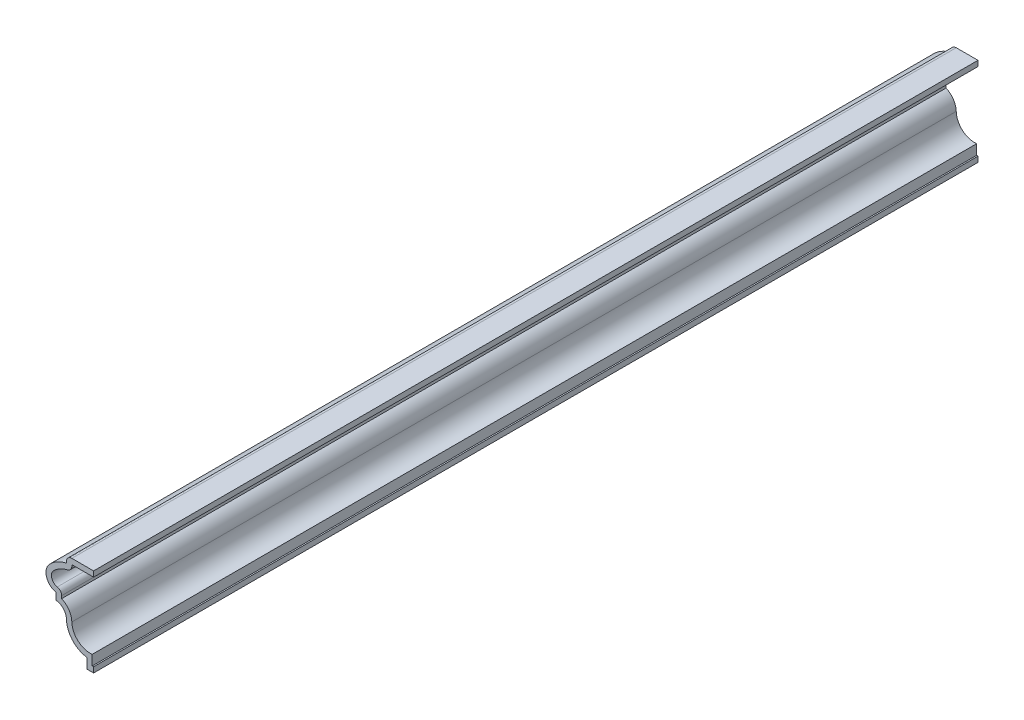
ISO-10303-21;
HEADER;
FILE_DESCRIPTION(('STEP AP214'),'2;1');
FILE_NAME('part.step','',(''),(''),'','','');
FILE_SCHEMA(('AUTOMOTIVE_DESIGN { 1 0 10303 214 1 1 1 1 }'));
ENDSEC;
DATA;
#1=APPLICATION_CONTEXT('core data for automotive mechanical design processes');
#2=APPLICATION_PROTOCOL_DEFINITION('international standard','automotive_design',2000,#1);
#3=PRODUCT_CONTEXT('',#1,'mechanical');
#4=PRODUCT('Part','Part','',(#3));
#5=PRODUCT_RELATED_PRODUCT_CATEGORY('part','',(#4));
#6=PRODUCT_DEFINITION_FORMATION('','',#4);
#7=PRODUCT_DEFINITION_CONTEXT('part definition',#1,'design');
#8=PRODUCT_DEFINITION('design','',#6,#7);
#9=PRODUCT_DEFINITION_SHAPE('','',#8);
#10=(LENGTH_UNIT() NAMED_UNIT(*) SI_UNIT(.MILLI.,.METRE.));
#11=(NAMED_UNIT(*) PLANE_ANGLE_UNIT() SI_UNIT($,.RADIAN.));
#12=(NAMED_UNIT(*) SI_UNIT($,.STERADIAN.) SOLID_ANGLE_UNIT());
#13=UNCERTAINTY_MEASURE_WITH_UNIT(LENGTH_MEASURE(1.E-05),#10,'distance_accuracy_value','');
#14=(GEOMETRIC_REPRESENTATION_CONTEXT(3) GLOBAL_UNCERTAINTY_ASSIGNED_CONTEXT((#13)) GLOBAL_UNIT_ASSIGNED_CONTEXT((#10,
#11,#12)) REPRESENTATION_CONTEXT('',''));
#15=CARTESIAN_POINT('',(0.,0.,0.));
#16=DIRECTION('',(0.,0.,1.));
#17=DIRECTION('',(1.,0.,0.));
#18=AXIS2_PLACEMENT_3D('',#15,#16,#17);
#19=CARTESIAN_POINT('',(-6.35,19.3675,-206.375));
#20=DIRECTION('',(0.,-1.,0.));
#21=DIRECTION('',(0.,0.,-1.));
#22=AXIS2_PLACEMENT_3D('',#19,#20,#21);
#23=PLANE('',#22);
#24=DIRECTION('',(1.,0.,0.));
#25=VECTOR('',#24,1.);
#26=CARTESIAN_POINT('',(-6.35,19.3675,0.));
#27=LINE('',#26,#25);
#28=CARTESIAN_POINT('',(-5.08,19.3675,0.));
#29=VERTEX_POINT('',#28);
#30=CARTESIAN_POINT('',(0.,19.3675,0.));
#31=VERTEX_POINT('',#30);
#32=EDGE_CURVE('E260',#29,#31,#27,.T.);
#33=ORIENTED_EDGE('',*,*,#32,.F.);
#34=DIRECTION('',(0.,0.,1.));
#35=VECTOR('',#34,1.);
#36=CARTESIAN_POINT('',(-5.08,19.3675,-206.375));
#37=LINE('',#36,#35);
#38=CARTESIAN_POINT('',(-5.08,19.3675,-206.375));
#39=VERTEX_POINT('',#38);
#40=EDGE_CURVE('E214',#39,#29,#37,.T.);
#41=ORIENTED_EDGE('',*,*,#40,.F.);
#42=DIRECTION('',(1.,0.,0.));
#43=VECTOR('',#42,1.);
#44=CARTESIAN_POINT('',(-6.35,19.3675,-206.375));
#45=LINE('',#44,#43);
#46=CARTESIAN_POINT('',(0.,19.3675,-206.375));
#47=VERTEX_POINT('',#46);
#48=EDGE_CURVE('E195',#39,#47,#45,.T.);
#49=ORIENTED_EDGE('',*,*,#48,.T.);
#50=DIRECTION('',(0.,0.,1.));
#51=VECTOR('',#50,1.);
#52=CARTESIAN_POINT('',(0.,19.3675,-206.375));
#53=LINE('',#52,#51);
#54=EDGE_CURVE('E202',#47,#31,#53,.T.);
#55=ORIENTED_EDGE('',*,*,#54,.T.);
#56=EDGE_LOOP('',(#33,#41,#49,#55));
#57=FACE_BOUND('',#56,.T.);
#58=ADVANCED_FACE('F35',(#57),#23,.T.);
#59=CARTESIAN_POINT('',(-5.08,19.05,-206.375));
#60=DIRECTION('',(1.,0.,0.));
#61=DIRECTION('',(0.,0.,-1.));
#62=AXIS2_PLACEMENT_3D('',#59,#60,#61);
#63=PLANE('',#62);
#64=DIRECTION('',(0.,1.,0.));
#65=VECTOR('',#64,1.);
#66=CARTESIAN_POINT('',(-5.08,19.05,0.));
#67=LINE('',#66,#65);
#68=CARTESIAN_POINT('',(-5.08,19.05,0.));
#69=VERTEX_POINT('',#68);
#70=EDGE_CURVE('E215',#69,#29,#67,.T.);
#71=ORIENTED_EDGE('',*,*,#70,.F.);
#72=DIRECTION('',(0.,0.,1.));
#73=VECTOR('',#72,1.);
#74=CARTESIAN_POINT('',(-5.08,19.05,-206.375));
#75=LINE('',#74,#73);
#76=CARTESIAN_POINT('',(-5.08,19.05,-206.375));
#77=VERTEX_POINT('',#76);
#78=EDGE_CURVE('E360',#69,#77,#75,.F.);
#79=ORIENTED_EDGE('',*,*,#78,.T.);
#80=DIRECTION('',(0.,1.,0.));
#81=VECTOR('',#80,1.);
#82=CARTESIAN_POINT('',(-5.08,19.05,-206.375));
#83=LINE('',#82,#81);
#84=EDGE_CURVE('E210',#77,#39,#83,.T.);
#85=ORIENTED_EDGE('',*,*,#84,.T.);
#86=ORIENTED_EDGE('',*,*,#40,.T.);
#87=EDGE_LOOP('',(#71,#79,#85,#86));
#88=FACE_BOUND('',#87,.T.);
#89=ADVANCED_FACE('F373',(#88),#63,.T.);
#90=CARTESIAN_POINT('',(-4.56512125077606,11.2314693878179,-206.375));
#91=DIRECTION('',(0.,0.,1.));
#92=DIRECTION('',(1.,0.,0.));
#93=AXIS2_PLACEMENT_3D('',#90,#91,#92);
#94=CYLINDRICAL_SURFACE('',#93,6.74967661960632);
#95=CARTESIAN_POINT('',(-4.56512125077606,11.2314693878179,-206.375));
#96=DIRECTION('',(0.,0.,1.));
#97=DIRECTION('',(1.,0.,0.));
#98=AXIS2_PLACEMENT_3D('',#95,#96,#97);
#99=CIRCLE('',#98,6.74967661960632);
#100=CARTESIAN_POINT('',(-9.35374601610612,15.9882758087402,-206.375));
#101=VERTEX_POINT('',#100);
#102=CARTESIAN_POINT('',(-6.067345708682,17.8118535823258,-206.375));
#103=VERTEX_POINT('',#102);
#104=EDGE_CURVE('E256',#101,#103,#99,.F.);
#105=ORIENTED_EDGE('',*,*,#104,.T.);
#106=DIRECTION('',(0.,0.,1.));
#107=VECTOR('',#106,1.);
#108=CARTESIAN_POINT('',(-6.067345708682,17.8118535823258,-206.375));
#109=LINE('',#108,#107);
#110=CARTESIAN_POINT('',(-6.067345708682,17.8118535823258,0.));
#111=VERTEX_POINT('',#110);
#112=EDGE_CURVE('E357',#103,#111,#109,.T.);
#113=ORIENTED_EDGE('',*,*,#112,.T.);
#114=CARTESIAN_POINT('',(-4.56512125077606,11.2314693878179,0.));
#115=DIRECTION('',(0.,0.,1.));
#116=DIRECTION('',(1.,0.,0.));
#117=AXIS2_PLACEMENT_3D('',#114,#115,#116);
#118=CIRCLE('',#117,6.74967661960632);
#119=CARTESIAN_POINT('',(-9.35374601610612,15.9882758087402,0.));
#120=VERTEX_POINT('',#119);
#121=EDGE_CURVE('E217',#120,#111,#118,.F.);
#122=ORIENTED_EDGE('',*,*,#121,.F.);
#123=DIRECTION('',(0.,0.,1.));
#124=VECTOR('',#123,1.);
#125=CARTESIAN_POINT('',(-9.35374601610612,15.9882758087402,-206.375));
#126=LINE('',#125,#124);
#127=EDGE_CURVE('E304',#101,#120,#126,.T.);
#128=ORIENTED_EDGE('',*,*,#127,.F.);
#129=EDGE_LOOP('',(#105,#113,#122,#128));
#130=FACE_BOUND('',#129,.T.);
#131=ADVANCED_FACE('F381',(#130),#94,.F.);
#132=CARTESIAN_POINT('',(-8.16027455010467,14.8027344454315,-206.375));
#133=DIRECTION('',(0.,0.,1.));
#134=DIRECTION('',(1.,0.,0.));
#135=AXIS2_PLACEMENT_3D('',#132,#133,#134);
#136=CYLINDRICAL_SURFACE('',#135,1.68222544989533);
#137=CARTESIAN_POINT('',(-8.16027455010467,14.8027344454315,0.));
#138=DIRECTION('',(0.,0.,1.));
#139=DIRECTION('',(1.,0.,0.));
#140=AXIS2_PLACEMENT_3D('',#137,#138,#139);
#141=CIRCLE('',#140,1.68222544989533);
#142=CARTESIAN_POINT('',(-8.48562552664117,13.1522711146233,0.));
#143=VERTEX_POINT('',#142);
#144=EDGE_CURVE('E298',#143,#120,#141,.F.);
#145=ORIENTED_EDGE('',*,*,#144,.F.);
#146=DIRECTION('',(0.,0.,1.));
#147=VECTOR('',#146,1.);
#148=CARTESIAN_POINT('',(-8.48562552664117,13.1522711146233,-206.375));
#149=LINE('',#148,#147);
#150=CARTESIAN_POINT('',(-8.48562552664117,13.1522711146233,-206.375));
#151=VERTEX_POINT('',#150);
#152=EDGE_CURVE('E350',#143,#151,#149,.F.);
#153=ORIENTED_EDGE('',*,*,#152,.T.);
#154=CARTESIAN_POINT('',(-8.16027455010467,14.8027344454315,-206.375));
#155=DIRECTION('',(0.,0.,1.));
#156=DIRECTION('',(1.,0.,0.));
#157=AXIS2_PLACEMENT_3D('',#154,#155,#156);
#158=CIRCLE('',#157,1.68222544989533);
#159=EDGE_CURVE('E254',#151,#101,#158,.F.);
#160=ORIENTED_EDGE('',*,*,#159,.T.);
#161=ORIENTED_EDGE('',*,*,#127,.T.);
#162=EDGE_LOOP('',(#145,#153,#160,#161));
#163=FACE_BOUND('',#162,.T.);
#164=ADVANCED_FACE('F386',(#163),#136,.F.);
#165=CARTESIAN_POINT('',(-7.46125,10.31875,-206.375));
#166=DIRECTION('',(1.,0.,0.));
#167=DIRECTION('',(0.,1.,0.));
#168=AXIS2_PLACEMENT_3D('',#165,#166,#167);
#169=PLANE('',#168);
#170=DIRECTION('',(0.,1.,0.));
#171=VECTOR('',#170,1.);
#172=CARTESIAN_POINT('',(-7.46125,10.31875,-206.375));
#173=LINE('',#172,#171);
#174=CARTESIAN_POINT('',(-7.46125,11.2903526424867,-206.375));
#175=VERTEX_POINT('',#174);
#176=CARTESIAN_POINT('',(-7.46125,11.90625,-206.375));
#177=VERTEX_POINT('',#176);
#178=EDGE_CURVE('E251',#175,#177,#173,.T.);
#179=ORIENTED_EDGE('',*,*,#178,.T.);
#180=DIRECTION('',(0.,0.,1.));
#181=VECTOR('',#180,1.);
#182=CARTESIAN_POINT('',(-7.46125,11.90625,-206.375));
#183=LINE('',#182,#181);
#184=CARTESIAN_POINT('',(-7.46125,11.90625,0.));
#185=VERTEX_POINT('',#184);
#186=EDGE_CURVE('E303',#177,#185,#183,.T.);
#187=ORIENTED_EDGE('',*,*,#186,.T.);
#188=DIRECTION('',(0.,1.,0.));
#189=VECTOR('',#188,1.);
#190=CARTESIAN_POINT('',(-7.46125,10.31875,0.));
#191=LINE('',#190,#189);
#192=CARTESIAN_POINT('',(-7.46125,11.2903526424867,0.));
#193=VERTEX_POINT('',#192);
#194=EDGE_CURVE('E295',#193,#185,#191,.T.);
#195=ORIENTED_EDGE('',*,*,#194,.F.);
#196=DIRECTION('',(0.,0.,1.));
#197=VECTOR('',#196,1.);
#198=CARTESIAN_POINT('',(-7.46125,11.2903526424867,-206.375));
#199=LINE('',#198,#197);
#200=EDGE_CURVE('E307',#175,#193,#199,.T.);
#201=ORIENTED_EDGE('',*,*,#200,.F.);
#202=EDGE_LOOP('',(#179,#187,#195,#201));
#203=FACE_BOUND('',#202,.T.);
#204=ADVANCED_FACE('F394',(#203),#169,.T.);
#205=CARTESIAN_POINT('',(-8.98965113130892,7.69111942114424,-206.375));
#206=DIRECTION('',(0.,0.,1.));
#207=DIRECTION('',(1.,0.,0.));
#208=AXIS2_PLACEMENT_3D('',#205,#206,#207);
#209=CYLINDRICAL_SURFACE('',#208,3.91030558905585);
#210=CARTESIAN_POINT('',(-8.98965113130892,7.69111942114424,0.));
#211=DIRECTION('',(0.,0.,1.));
#212=DIRECTION('',(1.,0.,0.));
#213=AXIS2_PLACEMENT_3D('',#210,#211,#212);
#214=CIRCLE('',#213,3.91030558905585);
#215=CARTESIAN_POINT('',(-5.0803147974015,7.77817818401578,0.));
#216=VERTEX_POINT('',#215);
#217=EDGE_CURVE('E292',#216,#193,#214,.T.);
#218=ORIENTED_EDGE('',*,*,#217,.F.);
#219=DIRECTION('',(0.,0.,1.));
#220=VECTOR('',#219,1.);
#221=CARTESIAN_POINT('',(-5.0803147974015,7.77817818401578,-206.375));
#222=LINE('',#221,#220);
#223=CARTESIAN_POINT('',(-5.0803147974015,7.77817818401578,-206.375));
#224=VERTEX_POINT('',#223);
#225=EDGE_CURVE('E309',#224,#216,#222,.T.);
#226=ORIENTED_EDGE('',*,*,#225,.F.);
#227=CARTESIAN_POINT('',(-8.98965113130892,7.69111942114424,-206.375));
#228=DIRECTION('',(0.,0.,1.));
#229=DIRECTION('',(1.,0.,0.));
#230=AXIS2_PLACEMENT_3D('',#227,#228,#229);
#231=CIRCLE('',#230,3.91030558905585);
#232=EDGE_CURVE('E248',#224,#175,#231,.T.);
#233=ORIENTED_EDGE('',*,*,#232,.T.);
#234=ORIENTED_EDGE('',*,*,#200,.T.);
#235=EDGE_LOOP('',(#218,#226,#233,#234));
#236=FACE_BOUND('',#235,.T.);
#237=ADVANCED_FACE('F398',(#236),#209,.T.);
#238=CARTESIAN_POINT('',(-0.803535121670571,7.8734197073439,-206.375));
#239=DIRECTION('',(0.,0.,1.));
#240=DIRECTION('',(1.,0.,0.));
#241=AXIS2_PLACEMENT_3D('',#238,#239,#240);
#242=CYLINDRICAL_SURFACE('',#241,4.27784003236575);
#243=CARTESIAN_POINT('',(-0.803535121670571,7.8734197073439,0.));
#244=DIRECTION('',(0.,0.,1.));
#245=DIRECTION('',(1.,0.,0.));
#246=AXIS2_PLACEMENT_3D('',#243,#244,#245);
#247=CIRCLE('',#246,4.27784003236575);
#248=CARTESIAN_POINT('',(-0.3175,3.62328027398248,0.));
#249=VERTEX_POINT('',#248);
#250=EDGE_CURVE('E289',#249,#216,#247,.F.);
#251=ORIENTED_EDGE('',*,*,#250,.F.);
#252=DIRECTION('',(0.,0.,1.));
#253=VECTOR('',#252,1.);
#254=CARTESIAN_POINT('',(-0.3175,3.62328027398248,-206.375));
#255=LINE('',#254,#253);
#256=CARTESIAN_POINT('',(-0.3175,3.62328027398248,-206.375));
#257=VERTEX_POINT('',#256);
#258=EDGE_CURVE('E311',#257,#249,#255,.T.);
#259=ORIENTED_EDGE('',*,*,#258,.F.);
#260=CARTESIAN_POINT('',(-0.803535121670571,7.8734197073439,-206.375));
#261=DIRECTION('',(0.,0.,1.));
#262=DIRECTION('',(1.,0.,0.));
#263=AXIS2_PLACEMENT_3D('',#260,#261,#262);
#264=CIRCLE('',#263,4.27784003236575);
#265=EDGE_CURVE('E245',#257,#224,#264,.F.);
#266=ORIENTED_EDGE('',*,*,#265,.T.);
#267=ORIENTED_EDGE('',*,*,#225,.T.);
#268=EDGE_LOOP('',(#251,#259,#266,#267));
#269=FACE_BOUND('',#268,.T.);
#270=ADVANCED_FACE('F403',(#269),#242,.F.);
#271=CARTESIAN_POINT('',(-0.3175,0.,-206.375));
#272=DIRECTION('',(1.,0.,0.));
#273=DIRECTION('',(0.,0.,-1.));
#274=AXIS2_PLACEMENT_3D('',#271,#272,#273);
#275=PLANE('',#274);
#276=DIRECTION('',(0.,1.,0.));
#277=VECTOR('',#276,1.);
#278=CARTESIAN_POINT('',(-0.3175,0.,0.));
#279=LINE('',#278,#277);
#280=CARTESIAN_POINT('',(-0.3175,1.27,0.));
#281=VERTEX_POINT('',#280);
#282=EDGE_CURVE('E286',#281,#249,#279,.T.);
#283=ORIENTED_EDGE('',*,*,#282,.F.);
#284=DIRECTION('',(0.,0.,1.));
#285=VECTOR('',#284,1.);
#286=CARTESIAN_POINT('',(-0.3175,1.27,-206.375));
#287=LINE('',#286,#285);
#288=CARTESIAN_POINT('',(-0.3175,1.27,-206.375));
#289=VERTEX_POINT('',#288);
#290=EDGE_CURVE('E313',#289,#281,#287,.T.);
#291=ORIENTED_EDGE('',*,*,#290,.F.);
#292=DIRECTION('',(0.,1.,0.));
#293=VECTOR('',#292,1.);
#294=CARTESIAN_POINT('',(-0.3175,0.,-206.375));
#295=LINE('',#294,#293);
#296=EDGE_CURVE('E242',#289,#257,#295,.T.);
#297=ORIENTED_EDGE('',*,*,#296,.T.);
#298=ORIENTED_EDGE('',*,*,#258,.T.);
#299=EDGE_LOOP('',(#283,#291,#297,#298));
#300=FACE_BOUND('',#299,.T.);
#301=ADVANCED_FACE('F406',(#300),#275,.T.);
#302=CARTESIAN_POINT('',(0.,1.27,-206.375));
#303=DIRECTION('',(0.,1.,0.));
#304=DIRECTION('',(-1.,0.,0.));
#305=AXIS2_PLACEMENT_3D('',#302,#303,#304);
#306=PLANE('',#305);
#307=DIRECTION('',(-1.,0.,0.));
#308=VECTOR('',#307,1.);
#309=CARTESIAN_POINT('',(0.,1.27,0.));
#310=LINE('',#309,#308);
#311=CARTESIAN_POINT('',(0.,1.27,0.));
#312=VERTEX_POINT('',#311);
#313=EDGE_CURVE('E283',#312,#281,#310,.T.);
#314=ORIENTED_EDGE('',*,*,#313,.F.);
#315=DIRECTION('',(0.,0.,1.));
#316=VECTOR('',#315,1.);
#317=CARTESIAN_POINT('',(0.,1.27,-206.375));
#318=LINE('',#317,#316);
#319=CARTESIAN_POINT('',(0.,1.27,-206.375));
#320=VERTEX_POINT('',#319);
#321=EDGE_CURVE('E315',#320,#312,#318,.T.);
#322=ORIENTED_EDGE('',*,*,#321,.F.);
#323=DIRECTION('',(-1.,0.,0.));
#324=VECTOR('',#323,1.);
#325=CARTESIAN_POINT('',(0.,1.27,-206.375));
#326=LINE('',#325,#324);
#327=EDGE_CURVE('E239',#320,#289,#326,.T.);
#328=ORIENTED_EDGE('',*,*,#327,.T.);
#329=ORIENTED_EDGE('',*,*,#290,.T.);
#330=EDGE_LOOP('',(#314,#322,#328,#329));
#331=FACE_BOUND('',#330,.T.);
#332=ADVANCED_FACE('F410',(#331),#306,.T.);
#333=CARTESIAN_POINT('',(0.,1.27,-206.375));
#334=DIRECTION('',(-1.,0.,0.));
#335=DIRECTION('',(0.,-1.,0.));
#336=AXIS2_PLACEMENT_3D('',#333,#334,#335);
#337=PLANE('',#336);
#338=DIRECTION('',(0.,-1.,0.));
#339=VECTOR('',#338,1.);
#340=CARTESIAN_POINT('',(0.,1.27,0.));
#341=LINE('',#340,#339);
#342=CARTESIAN_POINT('',(0.,0.,0.));
#343=VERTEX_POINT('',#342);
#344=EDGE_CURVE('E281',#312,#343,#341,.T.);
#345=ORIENTED_EDGE('',*,*,#344,.T.);
#346=DIRECTION('',(0.,0.,1.));
#347=VECTOR('',#346,1.);
#348=CARTESIAN_POINT('',(0.,0.,-206.375));
#349=LINE('',#348,#347);
#350=CARTESIAN_POINT('',(0.,0.,-206.375));
#351=VERTEX_POINT('',#350);
#352=EDGE_CURVE('E317',#351,#343,#349,.T.);
#353=ORIENTED_EDGE('',*,*,#352,.F.);
#354=DIRECTION('',(0.,-1.,0.));
#355=VECTOR('',#354,1.);
#356=CARTESIAN_POINT('',(0.,1.27,-206.375));
#357=LINE('',#356,#355);
#358=EDGE_CURVE('E237',#320,#351,#357,.T.);
#359=ORIENTED_EDGE('',*,*,#358,.F.);
#360=ORIENTED_EDGE('',*,*,#321,.T.);
#361=EDGE_LOOP('',(#345,#353,#359,#360));
#362=FACE_BOUND('',#361,.T.);
#363=ADVANCED_FACE('F415',(#362),#337,.F.);
#364=CARTESIAN_POINT('',(0.,0.,-206.375));
#365=DIRECTION('',(0.,1.,0.));
#366=DIRECTION('',(-1.,0.,0.));
#367=AXIS2_PLACEMENT_3D('',#364,#365,#366);
#368=PLANE('',#367);
#369=DIRECTION('',(-1.,0.,0.));
#370=VECTOR('',#369,1.);
#371=CARTESIAN_POINT('',(0.,0.,0.));
#372=LINE('',#371,#370);
#373=CARTESIAN_POINT('',(-1.5875,0.,0.));
#374=VERTEX_POINT('',#373);
#375=EDGE_CURVE('E279',#343,#374,#372,.T.);
#376=ORIENTED_EDGE('',*,*,#375,.T.);
#377=DIRECTION('',(0.,0.,1.));
#378=VECTOR('',#377,1.);
#379=CARTESIAN_POINT('',(-1.5875,0.,-206.375));
#380=LINE('',#379,#378);
#381=CARTESIAN_POINT('',(-1.5875,0.,-206.375));
#382=VERTEX_POINT('',#381);
#383=EDGE_CURVE('E320',#382,#374,#380,.T.);
#384=ORIENTED_EDGE('',*,*,#383,.F.);
#385=DIRECTION('',(-1.,0.,0.));
#386=VECTOR('',#385,1.);
#387=CARTESIAN_POINT('',(0.,0.,-206.375));
#388=LINE('',#387,#386);
#389=EDGE_CURVE('E235',#351,#382,#388,.T.);
#390=ORIENTED_EDGE('',*,*,#389,.F.);
#391=ORIENTED_EDGE('',*,*,#352,.T.);
#392=EDGE_LOOP('',(#376,#384,#390,#391));
#393=FACE_BOUND('',#392,.T.);
#394=ADVANCED_FACE('F421',(#393),#368,.F.);
#395=CARTESIAN_POINT('',(-1.5875,0.,-206.375));
#396=DIRECTION('',(1.,0.,0.));
#397=DIRECTION('',(0.,0.,-1.));
#398=AXIS2_PLACEMENT_3D('',#395,#396,#397);
#399=PLANE('',#398);
#400=DIRECTION('',(0.,1.,0.));
#401=VECTOR('',#400,1.);
#402=CARTESIAN_POINT('',(-1.5875,0.,0.));
#403=LINE('',#402,#401);
#404=CARTESIAN_POINT('',(-1.5875,2.38125,0.));
#405=VERTEX_POINT('',#404);
#406=EDGE_CURVE('E277',#374,#405,#403,.T.);
#407=ORIENTED_EDGE('',*,*,#406,.T.);
#408=DIRECTION('',(0.,0.,1.));
#409=VECTOR('',#408,1.);
#410=CARTESIAN_POINT('',(-1.5875,2.38125,-206.375));
#411=LINE('',#410,#409);
#412=CARTESIAN_POINT('',(-1.5875,2.38125,-206.375));
#413=VERTEX_POINT('',#412);
#414=EDGE_CURVE('E323',#413,#405,#411,.T.);
#415=ORIENTED_EDGE('',*,*,#414,.F.);
#416=DIRECTION('',(0.,1.,0.));
#417=VECTOR('',#416,1.);
#418=CARTESIAN_POINT('',(-1.5875,0.,-206.375));
#419=LINE('',#418,#417);
#420=EDGE_CURVE('E233',#382,#413,#419,.T.);
#421=ORIENTED_EDGE('',*,*,#420,.F.);
#422=ORIENTED_EDGE('',*,*,#383,.T.);
#423=EDGE_LOOP('',(#407,#415,#421,#422));
#424=FACE_BOUND('',#423,.T.);
#425=ADVANCED_FACE('F425',(#424),#399,.F.);
#426=CARTESIAN_POINT('',(-0.803535121670571,7.8734197073439,-206.375));
#427=DIRECTION('',(0.,0.,1.));
#428=DIRECTION('',(1.,0.,0.));
#429=AXIS2_PLACEMENT_3D('',#426,#427,#428);
#430=CYLINDRICAL_SURFACE('',#429,5.54784003236575);
#431=CARTESIAN_POINT('',(-0.803535121670571,7.8734197073439,0.));
#432=DIRECTION('',(0.,0.,-1.));
#433=DIRECTION('',(-1.,0.,0.));
#434=AXIS2_PLACEMENT_3D('',#431,#432,#433);
#435=CIRCLE('',#434,5.54784003236575);
#436=CARTESIAN_POINT('',(-6.35,7.74990299520284,0.));
#437=VERTEX_POINT('',#436);
#438=EDGE_CURVE('E275',#405,#437,#435,.T.);
#439=ORIENTED_EDGE('',*,*,#438,.T.);
#440=DIRECTION('',(0.,0.,1.));
#441=VECTOR('',#440,1.);
#442=CARTESIAN_POINT('',(-6.35,7.74990299520284,-206.375));
#443=LINE('',#442,#441);
#444=CARTESIAN_POINT('',(-6.35,7.74990299520284,-206.375));
#445=VERTEX_POINT('',#444);
#446=EDGE_CURVE('E326',#445,#437,#443,.T.);
#447=ORIENTED_EDGE('',*,*,#446,.F.);
#448=CARTESIAN_POINT('',(-0.803535121670571,7.8734197073439,-206.375));
#449=DIRECTION('',(0.,0.,-1.));
#450=DIRECTION('',(-1.,0.,0.));
#451=AXIS2_PLACEMENT_3D('',#448,#449,#450);
#452=CIRCLE('',#451,5.54784003236575);
#453=EDGE_CURVE('E231',#413,#445,#452,.T.);
#454=ORIENTED_EDGE('',*,*,#453,.F.);
#455=ORIENTED_EDGE('',*,*,#414,.T.);
#456=EDGE_LOOP('',(#439,#447,#454,#455));
#457=FACE_BOUND('',#456,.T.);
#458=ADVANCED_FACE('F430',(#457),#430,.T.);
#459=CARTESIAN_POINT('',(-8.98965113130892,7.69111942114424,-206.375));
#460=DIRECTION('',(0.,0.,1.));
#461=DIRECTION('',(1.,0.,0.));
#462=AXIS2_PLACEMENT_3D('',#459,#460,#461);
#463=CYLINDRICAL_SURFACE('',#462,2.64030558905585);
#464=CARTESIAN_POINT('',(-8.98965113130892,7.69111942114424,0.));
#465=DIRECTION('',(0.,0.,1.));
#466=DIRECTION('',(1.,0.,0.));
#467=AXIS2_PLACEMENT_3D('',#464,#465,#466);
#468=CIRCLE('',#467,2.64030558905585);
#469=CARTESIAN_POINT('',(-8.73125,10.31875,0.));
#470=VERTEX_POINT('',#469);
#471=EDGE_CURVE('E273',#437,#470,#468,.T.);
#472=ORIENTED_EDGE('',*,*,#471,.T.);
#473=DIRECTION('',(0.,0.,1.));
#474=VECTOR('',#473,1.);
#475=CARTESIAN_POINT('',(-8.73125,10.31875,-206.375));
#476=LINE('',#475,#474);
#477=CARTESIAN_POINT('',(-8.73125,10.31875,-206.375));
#478=VERTEX_POINT('',#477);
#479=EDGE_CURVE('E329',#478,#470,#476,.T.);
#480=ORIENTED_EDGE('',*,*,#479,.F.);
#481=CARTESIAN_POINT('',(-8.98965113130892,7.69111942114424,-206.375));
#482=DIRECTION('',(0.,0.,1.));
#483=DIRECTION('',(1.,0.,0.));
#484=AXIS2_PLACEMENT_3D('',#481,#482,#483);
#485=CIRCLE('',#484,2.64030558905585);
#486=EDGE_CURVE('E229',#445,#478,#485,.T.);
#487=ORIENTED_EDGE('',*,*,#486,.F.);
#488=ORIENTED_EDGE('',*,*,#446,.T.);
#489=EDGE_LOOP('',(#472,#480,#487,#488));
#490=FACE_BOUND('',#489,.T.);
#491=ADVANCED_FACE('F436',(#490),#463,.F.);
#492=CARTESIAN_POINT('',(-8.73125,10.31875,-206.375));
#493=DIRECTION('',(1.,0.,0.));
#494=DIRECTION('',(0.,1.,0.));
#495=AXIS2_PLACEMENT_3D('',#492,#493,#494);
#496=PLANE('',#495);
#497=DIRECTION('',(0.,1.,0.));
#498=VECTOR('',#497,1.);
#499=CARTESIAN_POINT('',(-8.73125,10.31875,0.));
#500=LINE('',#499,#498);
#501=CARTESIAN_POINT('',(-8.73125,11.90625,0.));
#502=VERTEX_POINT('',#501);
#503=EDGE_CURVE('E271',#470,#502,#500,.T.);
#504=ORIENTED_EDGE('',*,*,#503,.T.);
#505=DIRECTION('',(0.,0.,1.));
#506=VECTOR('',#505,1.);
#507=CARTESIAN_POINT('',(-8.73125,11.90625,-206.375));
#508=LINE('',#507,#506);
#509=CARTESIAN_POINT('',(-8.73125,11.90625,-206.375));
#510=VERTEX_POINT('',#509);
#511=EDGE_CURVE('E332',#510,#502,#508,.T.);
#512=ORIENTED_EDGE('',*,*,#511,.F.);
#513=DIRECTION('',(0.,1.,0.));
#514=VECTOR('',#513,1.);
#515=CARTESIAN_POINT('',(-8.73125,10.31875,-206.375));
#516=LINE('',#515,#514);
#517=EDGE_CURVE('E227',#478,#510,#516,.T.);
#518=ORIENTED_EDGE('',*,*,#517,.F.);
#519=ORIENTED_EDGE('',*,*,#479,.T.);
#520=EDGE_LOOP('',(#504,#512,#518,#519));
#521=FACE_BOUND('',#520,.T.);
#522=ADVANCED_FACE('F440',(#521),#496,.F.);
#523=CARTESIAN_POINT('',(-8.16027455010467,14.8027344454315,-206.375));
#524=DIRECTION('',(0.,0.,1.));
#525=DIRECTION('',(1.,0.,0.));
#526=AXIS2_PLACEMENT_3D('',#523,#524,#525);
#527=CYLINDRICAL_SURFACE('',#526,2.95222544989533);
#528=CARTESIAN_POINT('',(-8.16027455010467,14.8027344454315,0.));
#529=DIRECTION('',(0.,0.,-1.));
#530=DIRECTION('',(-1.,0.,0.));
#531=AXIS2_PLACEMENT_3D('',#528,#529,#530);
#532=CIRCLE('',#531,2.95222544989533);
#533=CARTESIAN_POINT('',(-10.2547600638464,16.8833030070838,0.));
#534=VERTEX_POINT('',#533);
#535=EDGE_CURVE('E269',#502,#534,#532,.T.);
#536=ORIENTED_EDGE('',*,*,#535,.T.);
#537=DIRECTION('',(0.,0.,1.));
#538=VECTOR('',#537,1.);
#539=CARTESIAN_POINT('',(-10.2547600638464,16.8833030070838,-206.375));
#540=LINE('',#539,#538);
#541=CARTESIAN_POINT('',(-10.2547600638464,16.8833030070838,-206.375));
#542=VERTEX_POINT('',#541);
#543=EDGE_CURVE('E335',#542,#534,#540,.T.);
#544=ORIENTED_EDGE('',*,*,#543,.F.);
#545=CARTESIAN_POINT('',(-8.16027455010467,14.8027344454315,-206.375));
#546=DIRECTION('',(0.,0.,-1.));
#547=DIRECTION('',(-1.,0.,0.));
#548=AXIS2_PLACEMENT_3D('',#545,#546,#547);
#549=CIRCLE('',#548,2.95222544989533);
#550=EDGE_CURVE('E225',#510,#542,#549,.T.);
#551=ORIENTED_EDGE('',*,*,#550,.F.);
#552=ORIENTED_EDGE('',*,*,#511,.T.);
#553=EDGE_LOOP('',(#536,#544,#551,#552));
#554=FACE_BOUND('',#553,.T.);
#555=ADVANCED_FACE('F445',(#554),#527,.T.);
#556=CARTESIAN_POINT('',(-4.56512125077606,11.2314693878179,-206.375));
#557=DIRECTION('',(0.,0.,1.));
#558=DIRECTION('',(1.,0.,0.));
#559=AXIS2_PLACEMENT_3D('',#556,#557,#558);
#560=CYLINDRICAL_SURFACE('',#559,8.01967661960632);
#561=CARTESIAN_POINT('',(-4.56512125077606,11.2314693878179,0.));
#562=DIRECTION('',(0.,0.,-1.));
#563=DIRECTION('',(-1.,0.,0.));
#564=AXIS2_PLACEMENT_3D('',#561,#562,#563);
#565=CIRCLE('',#564,8.01967661960632);
#566=CARTESIAN_POINT('',(-6.35,19.05,0.));
#567=VERTEX_POINT('',#566);
#568=EDGE_CURVE('E267',#534,#567,#565,.T.);
#569=ORIENTED_EDGE('',*,*,#568,.T.);
#570=DIRECTION('',(0.,0.,1.));
#571=VECTOR('',#570,1.);
#572=CARTESIAN_POINT('',(-6.35,19.05,-206.375));
#573=LINE('',#572,#571);
#574=CARTESIAN_POINT('',(-6.35,19.05,-206.375));
#575=VERTEX_POINT('',#574);
#576=EDGE_CURVE('E338',#575,#567,#573,.T.);
#577=ORIENTED_EDGE('',*,*,#576,.F.);
#578=CARTESIAN_POINT('',(-4.56512125077606,11.2314693878179,-206.375));
#579=DIRECTION('',(0.,0.,-1.));
#580=DIRECTION('',(-1.,0.,0.));
#581=AXIS2_PLACEMENT_3D('',#578,#579,#580);
#582=CIRCLE('',#581,8.01967661960632);
#583=EDGE_CURVE('E223',#542,#575,#582,.T.);
#584=ORIENTED_EDGE('',*,*,#583,.F.);
#585=ORIENTED_EDGE('',*,*,#543,.T.);
#586=EDGE_LOOP('',(#569,#577,#584,#585));
#587=FACE_BOUND('',#586,.T.);
#588=ADVANCED_FACE('F449',(#587),#560,.T.);
#589=CARTESIAN_POINT('',(-6.35,19.05,-206.375));
#590=DIRECTION('',(1.,0.,0.));
#591=DIRECTION('',(0.,0.,-1.));
#592=AXIS2_PLACEMENT_3D('',#589,#590,#591);
#593=PLANE('',#592);
#594=DIRECTION('',(0.,1.,0.));
#595=VECTOR('',#594,1.);
#596=CARTESIAN_POINT('',(-6.35,19.05,0.));
#597=LINE('',#596,#595);
#598=CARTESIAN_POINT('',(-6.35,19.3675,0.));
#599=VERTEX_POINT('',#598);
#600=EDGE_CURVE('E265',#567,#599,#597,.T.);
#601=ORIENTED_EDGE('',*,*,#600,.T.);
#602=DIRECTION('',(0.,0.,1.));
#603=VECTOR('',#602,1.);
#604=CARTESIAN_POINT('',(-6.35,19.3675,-206.375));
#605=LINE('',#604,#603);
#606=CARTESIAN_POINT('',(-6.35,19.3675,-206.375));
#607=VERTEX_POINT('',#606);
#608=EDGE_CURVE('E11',#599,#607,#605,.F.);
#609=ORIENTED_EDGE('',*,*,#608,.T.);
#610=DIRECTION('',(0.,1.,0.));
#611=VECTOR('',#610,1.);
#612=CARTESIAN_POINT('',(-6.35,19.05,-206.375));
#613=LINE('',#612,#611);
#614=EDGE_CURVE('E221',#575,#607,#613,.T.);
#615=ORIENTED_EDGE('',*,*,#614,.F.);
#616=ORIENTED_EDGE('',*,*,#576,.T.);
#617=EDGE_LOOP('',(#601,#609,#615,#616));
#618=FACE_BOUND('',#617,.T.);
#619=ADVANCED_FACE('F451',(#618),#593,.F.);
#620=CARTESIAN_POINT('',(-6.35,20.6375,-206.375));
#621=DIRECTION('',(0.,-1.,0.));
#622=DIRECTION('',(0.,0.,-1.));
#623=AXIS2_PLACEMENT_3D('',#620,#621,#622);
#624=PLANE('',#623);
#625=DIRECTION('',(1.,0.,0.));
#626=VECTOR('',#625,1.);
#627=CARTESIAN_POINT('',(-6.35,20.6375,-206.375));
#628=LINE('',#627,#626);
#629=CARTESIAN_POINT('',(-5.08,20.6375,-206.375));
#630=VERTEX_POINT('',#629);
#631=CARTESIAN_POINT('',(0.,20.6375,-206.375));
#632=VERTEX_POINT('',#631);
#633=EDGE_CURVE('E196',#630,#632,#628,.T.);
#634=ORIENTED_EDGE('',*,*,#633,.F.);
#635=DIRECTION('',(0.,0.,1.));
#636=VECTOR('',#635,1.);
#637=CARTESIAN_POINT('',(-5.08,20.6375,-206.375));
#638=LINE('',#637,#636);
#639=CARTESIAN_POINT('',(-5.08,20.6375,0.));
#640=VERTEX_POINT('',#639);
#641=EDGE_CURVE('E43',#630,#640,#638,.T.);
#642=ORIENTED_EDGE('',*,*,#641,.T.);
#643=DIRECTION('',(1.,0.,0.));
#644=VECTOR('',#643,1.);
#645=CARTESIAN_POINT('',(-6.35,20.6375,0.));
#646=LINE('',#645,#644);
#647=CARTESIAN_POINT('',(0.,20.6375,0.));
#648=VERTEX_POINT('',#647);
#649=EDGE_CURVE('E263',#640,#648,#646,.T.);
#650=ORIENTED_EDGE('',*,*,#649,.T.);
#651=DIRECTION('',(0.,0.,1.));
#652=VECTOR('',#651,1.);
#653=CARTESIAN_POINT('',(0.,20.6375,-206.375));
#654=LINE('',#653,#652);
#655=EDGE_CURVE('E209',#632,#648,#654,.T.);
#656=ORIENTED_EDGE('',*,*,#655,.F.);
#657=EDGE_LOOP('',(#634,#642,#650,#656));
#658=FACE_BOUND('',#657,.T.);
#659=ADVANCED_FACE('F365',(#658),#624,.F.);
#660=CARTESIAN_POINT('',(0.,20.6375,-206.375));
#661=DIRECTION('',(-1.,0.,0.));
#662=DIRECTION('',(0.,0.,1.));
#663=AXIS2_PLACEMENT_3D('',#660,#661,#662);
#664=PLANE('',#663);
#665=DIRECTION('',(0.,-1.,0.));
#666=VECTOR('',#665,1.);
#667=CARTESIAN_POINT('',(0.,20.6375,0.));
#668=LINE('',#667,#666);
#669=EDGE_CURVE('E205',#648,#31,#668,.T.);
#670=ORIENTED_EDGE('',*,*,#669,.T.);
#671=ORIENTED_EDGE('',*,*,#54,.F.);
#672=DIRECTION('',(0.,-1.,0.));
#673=VECTOR('',#672,1.);
#674=CARTESIAN_POINT('',(0.,20.6375,-206.375));
#675=LINE('',#674,#673);
#676=EDGE_CURVE('E189',#632,#47,#675,.T.);
#677=ORIENTED_EDGE('',*,*,#676,.F.);
#678=ORIENTED_EDGE('',*,*,#655,.T.);
#679=EDGE_LOOP('',(#670,#671,#677,#678));
#680=FACE_BOUND('',#679,.T.);
#681=ADVANCED_FACE('F203',(#680),#664,.F.);
#682=CARTESIAN_POINT('',(-4.56512125077606,11.2314693878179,-206.375));
#683=DIRECTION('',(0.,0.,-1.));
#684=DIRECTION('',(-1.,0.,0.));
#685=AXIS2_PLACEMENT_3D('',#682,#683,#684);
#686=PLANE('',#685);
#687=ORIENTED_EDGE('',*,*,#159,.F.);
#688=CARTESIAN_POINT('',(-8.73125,11.90625,-206.375));
#689=DIRECTION('',(0.,0.,-1.));
#690=DIRECTION('',(-1.,0.,0.));
#691=AXIS2_PLACEMENT_3D('',#688,#689,#690);
#692=CIRCLE('',#691,1.27);
#693=EDGE_CURVE('E355',#151,#177,#692,.T.);
#694=ORIENTED_EDGE('',*,*,#693,.T.);
#695=ORIENTED_EDGE('',*,*,#178,.F.);
#696=ORIENTED_EDGE('',*,*,#232,.F.);
#697=ORIENTED_EDGE('',*,*,#265,.F.);
#698=ORIENTED_EDGE('',*,*,#296,.F.);
#699=ORIENTED_EDGE('',*,*,#327,.F.);
#700=ORIENTED_EDGE('',*,*,#358,.T.);
#701=ORIENTED_EDGE('',*,*,#389,.T.);
#702=ORIENTED_EDGE('',*,*,#420,.T.);
#703=ORIENTED_EDGE('',*,*,#453,.T.);
#704=ORIENTED_EDGE('',*,*,#486,.T.);
#705=ORIENTED_EDGE('',*,*,#517,.T.);
#706=ORIENTED_EDGE('',*,*,#550,.T.);
#707=ORIENTED_EDGE('',*,*,#583,.T.);
#708=ORIENTED_EDGE('',*,*,#614,.T.);
#709=CARTESIAN_POINT('',(-5.08,19.3675,-206.375));
#710=DIRECTION('',(0.,0.,-1.));
#711=DIRECTION('',(-1.,0.,0.));
#712=AXIS2_PLACEMENT_3D('',#709,#710,#711);
#713=CIRCLE('',#712,1.27);
#714=EDGE_CURVE('E50',#607,#630,#713,.T.);
#715=ORIENTED_EDGE('',*,*,#714,.T.);
#716=ORIENTED_EDGE('',*,*,#633,.T.);
#717=ORIENTED_EDGE('',*,*,#676,.T.);
#718=ORIENTED_EDGE('',*,*,#48,.F.);
#719=ORIENTED_EDGE('',*,*,#84,.F.);
#720=CARTESIAN_POINT('',(-6.35,19.05,-206.375));
#721=DIRECTION('',(0.,0.,-1.));
#722=DIRECTION('',(-1.,0.,0.));
#723=AXIS2_PLACEMENT_3D('',#720,#721,#722);
#724=CIRCLE('',#723,1.27);
#725=EDGE_CURVE('E353',#77,#103,#724,.T.);
#726=ORIENTED_EDGE('',*,*,#725,.T.);
#727=ORIENTED_EDGE('',*,*,#104,.F.);
#728=EDGE_LOOP('',(#687,#694,#695,#696,#697,#698,#699,#700,#701,#702,#703,#704,#705,#706,#707,
#708,#715,#716,#717,#718,#719,#726,#727));
#729=FACE_BOUND('',#728,.T.);
#730=ADVANCED_FACE('F192',(#729),#686,.T.);
#731=CARTESIAN_POINT('',(-4.56512125077606,11.2314693878179,0.));
#732=DIRECTION('',(0.,0.,-1.));
#733=DIRECTION('',(-1.,0.,0.));
#734=AXIS2_PLACEMENT_3D('',#731,#732,#733);
#735=PLANE('',#734);
#736=ORIENTED_EDGE('',*,*,#194,.T.);
#737=CARTESIAN_POINT('',(-8.73125,11.90625,0.));
#738=DIRECTION('',(0.,0.,-1.));
#739=DIRECTION('',(-1.,0.,0.));
#740=AXIS2_PLACEMENT_3D('',#737,#738,#739);
#741=CIRCLE('',#740,1.27);
#742=EDGE_CURVE('E348',#185,#143,#741,.F.);
#743=ORIENTED_EDGE('',*,*,#742,.T.);
#744=ORIENTED_EDGE('',*,*,#144,.T.);
#745=ORIENTED_EDGE('',*,*,#121,.T.);
#746=CARTESIAN_POINT('',(-6.35,19.05,0.));
#747=DIRECTION('',(0.,0.,-1.));
#748=DIRECTION('',(-1.,0.,0.));
#749=AXIS2_PLACEMENT_3D('',#746,#747,#748);
#750=CIRCLE('',#749,1.27);
#751=EDGE_CURVE('E346',#111,#69,#750,.F.);
#752=ORIENTED_EDGE('',*,*,#751,.T.);
#753=ORIENTED_EDGE('',*,*,#70,.T.);
#754=ORIENTED_EDGE('',*,*,#32,.T.);
#755=ORIENTED_EDGE('',*,*,#669,.F.);
#756=ORIENTED_EDGE('',*,*,#649,.F.);
#757=CARTESIAN_POINT('',(-5.08,19.3675,0.));
#758=DIRECTION('',(0.,0.,-1.));
#759=DIRECTION('',(-1.,0.,0.));
#760=AXIS2_PLACEMENT_3D('',#757,#758,#759);
#761=CIRCLE('',#760,1.27);
#762=EDGE_CURVE('E344',#640,#599,#761,.F.);
#763=ORIENTED_EDGE('',*,*,#762,.T.);
#764=ORIENTED_EDGE('',*,*,#600,.F.);
#765=ORIENTED_EDGE('',*,*,#568,.F.);
#766=ORIENTED_EDGE('',*,*,#535,.F.);
#767=ORIENTED_EDGE('',*,*,#503,.F.);
#768=ORIENTED_EDGE('',*,*,#471,.F.);
#769=ORIENTED_EDGE('',*,*,#438,.F.);
#770=ORIENTED_EDGE('',*,*,#406,.F.);
#771=ORIENTED_EDGE('',*,*,#375,.F.);
#772=ORIENTED_EDGE('',*,*,#344,.F.);
#773=ORIENTED_EDGE('',*,*,#313,.T.);
#774=ORIENTED_EDGE('',*,*,#282,.T.);
#775=ORIENTED_EDGE('',*,*,#250,.T.);
#776=ORIENTED_EDGE('',*,*,#217,.T.);
#777=EDGE_LOOP('',(#736,#743,#744,#745,#752,#753,#754,#755,#756,#763,#764,#765,#766,#767,#768,
#769,#770,#771,#772,#773,#774,#775,#776));
#778=FACE_BOUND('',#777,.T.);
#779=ADVANCED_FACE('F368',(#778),#735,.F.);
#780=CARTESIAN_POINT('',(-8.73125,11.90625,-206.375));
#781=DIRECTION('',(0.,0.,1.));
#782=DIRECTION('',(1.,0.,0.));
#783=AXIS2_PLACEMENT_3D('',#780,#781,#782);
#784=CYLINDRICAL_SURFACE('',#783,1.27);
#785=ORIENTED_EDGE('',*,*,#693,.F.);
#786=ORIENTED_EDGE('',*,*,#152,.F.);
#787=ORIENTED_EDGE('',*,*,#742,.F.);
#788=ORIENTED_EDGE('',*,*,#186,.F.);
#789=EDGE_LOOP('',(#785,#786,#787,#788));
#790=FACE_BOUND('',#789,.T.);
#791=ADVANCED_FACE('F391',(#790),#784,.T.);
#792=CARTESIAN_POINT('',(-6.35,19.05,-206.375));
#793=DIRECTION('',(0.,0.,1.));
#794=DIRECTION('',(1.,0.,0.));
#795=AXIS2_PLACEMENT_3D('',#792,#793,#794);
#796=CYLINDRICAL_SURFACE('',#795,1.27);
#797=ORIENTED_EDGE('',*,*,#725,.F.);
#798=ORIENTED_EDGE('',*,*,#78,.F.);
#799=ORIENTED_EDGE('',*,*,#751,.F.);
#800=ORIENTED_EDGE('',*,*,#112,.F.);
#801=EDGE_LOOP('',(#797,#798,#799,#800));
#802=FACE_BOUND('',#801,.T.);
#803=ADVANCED_FACE('F378',(#802),#796,.T.);
#804=CARTESIAN_POINT('',(-5.08,19.3675,-206.375));
#805=DIRECTION('',(0.,0.,1.));
#806=DIRECTION('',(1.,0.,0.));
#807=AXIS2_PLACEMENT_3D('',#804,#805,#806);
#808=CYLINDRICAL_SURFACE('',#807,1.27);
#809=ORIENTED_EDGE('',*,*,#714,.F.);
#810=ORIENTED_EDGE('',*,*,#608,.F.);
#811=ORIENTED_EDGE('',*,*,#762,.F.);
#812=ORIENTED_EDGE('',*,*,#641,.F.);
#813=EDGE_LOOP('',(#809,#810,#811,#812));
#814=FACE_BOUND('',#813,.T.);
#815=ADVANCED_FACE('F37',(#814),#808,.T.);
#816=CLOSED_SHELL('',(#58,#89,#131,#164,#204,#237,#270,#301,#332,#363,#394,#425,#458,#491,#522,
#555,#588,#619,#659,#681,#730,#779,#791,#803,#815));
#817=MANIFOLD_SOLID_BREP('B2',#816);
#818=ADVANCED_BREP_SHAPE_REPRESENTATION('',(#18,#817),#14);
#819=SHAPE_DEFINITION_REPRESENTATION(#9,#818);
ENDSEC;
END-ISO-10303-21;
